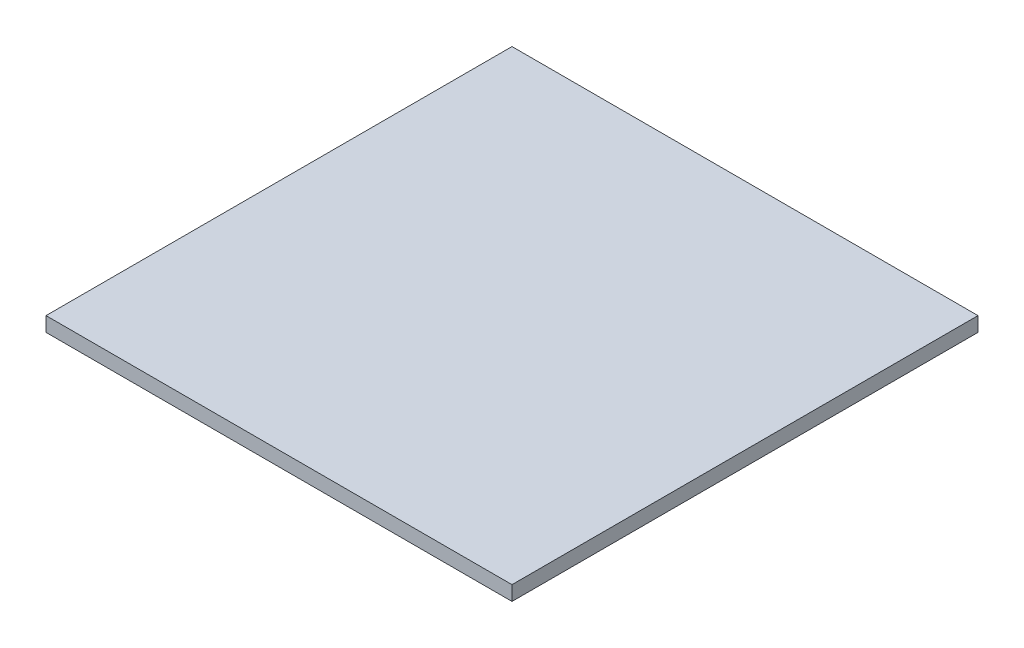
ISO-10303-21;
HEADER;
FILE_DESCRIPTION(('STEP AP214'),'2;1');
FILE_NAME('part.step','',(''),(''),'','','');
FILE_SCHEMA(('AUTOMOTIVE_DESIGN { 1 0 10303 214 1 1 1 1 }'));
ENDSEC;
DATA;
#1=APPLICATION_CONTEXT('core data for automotive mechanical design processes');
#2=APPLICATION_PROTOCOL_DEFINITION('international standard','automotive_design',2000,#1);
#3=PRODUCT_CONTEXT('',#1,'mechanical');
#4=PRODUCT('Part','Part','',(#3));
#5=PRODUCT_RELATED_PRODUCT_CATEGORY('part','',(#4));
#6=PRODUCT_DEFINITION_FORMATION('','',#4);
#7=PRODUCT_DEFINITION_CONTEXT('part definition',#1,'design');
#8=PRODUCT_DEFINITION('design','',#6,#7);
#9=PRODUCT_DEFINITION_SHAPE('','',#8);
#10=(LENGTH_UNIT() NAMED_UNIT(*) SI_UNIT(.MILLI.,.METRE.));
#11=(NAMED_UNIT(*) PLANE_ANGLE_UNIT() SI_UNIT($,.RADIAN.));
#12=(NAMED_UNIT(*) SI_UNIT($,.STERADIAN.) SOLID_ANGLE_UNIT());
#13=UNCERTAINTY_MEASURE_WITH_UNIT(LENGTH_MEASURE(1.E-05),#10,'distance_accuracy_value','');
#14=(GEOMETRIC_REPRESENTATION_CONTEXT(3) GLOBAL_UNCERTAINTY_ASSIGNED_CONTEXT((#13)) GLOBAL_UNIT_ASSIGNED_CONTEXT((#10,
#11,#12)) REPRESENTATION_CONTEXT('',''));
#15=CARTESIAN_POINT('',(0.,0.,0.));
#16=DIRECTION('',(0.,0.,1.));
#17=DIRECTION('',(1.,0.,0.));
#18=AXIS2_PLACEMENT_3D('',#15,#16,#17);
#19=CARTESIAN_POINT('',(0.,3.175,0.));
#20=DIRECTION('',(1.,0.,0.));
#21=DIRECTION('',(0.,0.,-1.));
#22=AXIS2_PLACEMENT_3D('',#19,#20,#21);
#23=PLANE('',#22);
#24=DIRECTION('',(0.,0.,1.));
#25=VECTOR('',#24,1.);
#26=CARTESIAN_POINT('',(0.,0.,0.));
#27=LINE('',#26,#25);
#28=CARTESIAN_POINT('',(0.,0.,-101.6));
#29=VERTEX_POINT('',#28);
#30=CARTESIAN_POINT('',(0.,0.,0.));
#31=VERTEX_POINT('',#30);
#32=EDGE_CURVE('E96',#29,#31,#27,.T.);
#33=ORIENTED_EDGE('',*,*,#32,.T.);
#34=DIRECTION('',(0.,-1.,0.));
#35=VECTOR('',#34,1.);
#36=CARTESIAN_POINT('',(0.,3.175,0.));
#37=LINE('',#36,#35);
#38=CARTESIAN_POINT('',(0.,3.175,0.));
#39=VERTEX_POINT('',#38);
#40=EDGE_CURVE('E11',#39,#31,#37,.T.);
#41=ORIENTED_EDGE('',*,*,#40,.F.);
#42=DIRECTION('',(0.,0.,1.));
#43=VECTOR('',#42,1.);
#44=CARTESIAN_POINT('',(0.,3.175,0.));
#45=LINE('',#44,#43);
#46=CARTESIAN_POINT('',(0.,3.175,-101.6));
#47=VERTEX_POINT('',#46);
#48=EDGE_CURVE('E84',#47,#39,#45,.T.);
#49=ORIENTED_EDGE('',*,*,#48,.F.);
#50=DIRECTION('',(0.,-1.,0.));
#51=VECTOR('',#50,1.);
#52=CARTESIAN_POINT('',(0.,3.175,-101.6));
#53=LINE('',#52,#51);
#54=EDGE_CURVE('E92',#47,#29,#53,.T.);
#55=ORIENTED_EDGE('',*,*,#54,.T.);
#56=EDGE_LOOP('',(#33,#41,#49,#55));
#57=FACE_BOUND('',#56,.T.);
#58=ADVANCED_FACE('F33',(#57),#23,.F.);
#59=CARTESIAN_POINT('',(0.,3.175,0.));
#60=DIRECTION('',(0.,0.,-1.));
#61=DIRECTION('',(-1.,0.,0.));
#62=AXIS2_PLACEMENT_3D('',#59,#60,#61);
#63=PLANE('',#62);
#64=DIRECTION('',(1.,0.,0.));
#65=VECTOR('',#64,1.);
#66=CARTESIAN_POINT('',(0.,0.,0.));
#67=LINE('',#66,#65);
#68=CARTESIAN_POINT('',(101.6,0.,0.));
#69=VERTEX_POINT('',#68);
#70=EDGE_CURVE('E88',#31,#69,#67,.T.);
#71=ORIENTED_EDGE('',*,*,#70,.T.);
#72=DIRECTION('',(0.,-1.,0.));
#73=VECTOR('',#72,1.);
#74=CARTESIAN_POINT('',(101.6,3.175,0.));
#75=LINE('',#74,#73);
#76=CARTESIAN_POINT('',(101.6,3.175,0.));
#77=VERTEX_POINT('',#76);
#78=EDGE_CURVE('E41',#77,#69,#75,.T.);
#79=ORIENTED_EDGE('',*,*,#78,.F.);
#80=DIRECTION('',(1.,0.,0.));
#81=VECTOR('',#80,1.);
#82=CARTESIAN_POINT('',(0.,3.175,0.));
#83=LINE('',#82,#81);
#84=EDGE_CURVE('E79',#39,#77,#83,.T.);
#85=ORIENTED_EDGE('',*,*,#84,.F.);
#86=ORIENTED_EDGE('',*,*,#40,.T.);
#87=EDGE_LOOP('',(#71,#79,#85,#86));
#88=FACE_BOUND('',#87,.T.);
#89=ADVANCED_FACE('F87',(#88),#63,.F.);
#90=CARTESIAN_POINT('',(101.6,3.175,0.));
#91=DIRECTION('',(-1.,0.,0.));
#92=DIRECTION('',(0.,0.,1.));
#93=AXIS2_PLACEMENT_3D('',#90,#91,#92);
#94=PLANE('',#93);
#95=DIRECTION('',(0.,0.,-1.));
#96=VECTOR('',#95,1.);
#97=CARTESIAN_POINT('',(101.6,0.,0.));
#98=LINE('',#97,#96);
#99=CARTESIAN_POINT('',(101.6,0.,-101.6));
#100=VERTEX_POINT('',#99);
#101=EDGE_CURVE('E66',#69,#100,#98,.T.);
#102=ORIENTED_EDGE('',*,*,#101,.T.);
#103=DIRECTION('',(0.,-1.,0.));
#104=VECTOR('',#103,1.);
#105=CARTESIAN_POINT('',(101.6,3.175,-101.6));
#106=LINE('',#105,#104);
#107=CARTESIAN_POINT('',(101.6,3.175,-101.6));
#108=VERTEX_POINT('',#107);
#109=EDGE_CURVE('E89',#108,#100,#106,.T.);
#110=ORIENTED_EDGE('',*,*,#109,.F.);
#111=DIRECTION('',(0.,0.,-1.));
#112=VECTOR('',#111,1.);
#113=CARTESIAN_POINT('',(101.6,3.175,0.));
#114=LINE('',#113,#112);
#115=EDGE_CURVE('E82',#77,#108,#114,.T.);
#116=ORIENTED_EDGE('',*,*,#115,.F.);
#117=ORIENTED_EDGE('',*,*,#78,.T.);
#118=EDGE_LOOP('',(#102,#110,#116,#117));
#119=FACE_BOUND('',#118,.T.);
#120=ADVANCED_FACE('F90',(#119),#94,.F.);
#121=CARTESIAN_POINT('',(0.,3.175,-101.6));
#122=DIRECTION('',(0.,0.,1.));
#123=DIRECTION('',(1.,0.,0.));
#124=AXIS2_PLACEMENT_3D('',#121,#122,#123);
#125=PLANE('',#124);
#126=DIRECTION('',(-1.,0.,0.));
#127=VECTOR('',#126,1.);
#128=CARTESIAN_POINT('',(0.,0.,-101.6));
#129=LINE('',#128,#127);
#130=EDGE_CURVE('E72',#100,#29,#129,.T.);
#131=ORIENTED_EDGE('',*,*,#130,.T.);
#132=ORIENTED_EDGE('',*,*,#54,.F.);
#133=DIRECTION('',(-1.,0.,0.));
#134=VECTOR('',#133,1.);
#135=CARTESIAN_POINT('',(0.,3.175,-101.6));
#136=LINE('',#135,#134);
#137=EDGE_CURVE('E49',#108,#47,#136,.T.);
#138=ORIENTED_EDGE('',*,*,#137,.F.);
#139=ORIENTED_EDGE('',*,*,#109,.T.);
#140=EDGE_LOOP('',(#131,#132,#138,#139));
#141=FACE_BOUND('',#140,.T.);
#142=ADVANCED_FACE('F103',(#141),#125,.F.);
#143=CARTESIAN_POINT('',(0.,3.175,0.));
#144=DIRECTION('',(0.,-1.,0.));
#145=DIRECTION('',(0.,0.,-1.));
#146=AXIS2_PLACEMENT_3D('',#143,#144,#145);
#147=PLANE('',#146);
#148=ORIENTED_EDGE('',*,*,#48,.T.);
#149=ORIENTED_EDGE('',*,*,#84,.T.);
#150=ORIENTED_EDGE('',*,*,#115,.T.);
#151=ORIENTED_EDGE('',*,*,#137,.T.);
#152=EDGE_LOOP('',(#148,#149,#150,#151));
#153=FACE_BOUND('',#152,.T.);
#154=ADVANCED_FACE('F80',(#153),#147,.F.);
#155=CARTESIAN_POINT('',(0.,0.,0.));
#156=DIRECTION('',(0.,-1.,0.));
#157=DIRECTION('',(0.,0.,-1.));
#158=AXIS2_PLACEMENT_3D('',#155,#156,#157);
#159=PLANE('',#158);
#160=ORIENTED_EDGE('',*,*,#32,.F.);
#161=ORIENTED_EDGE('',*,*,#130,.F.);
#162=ORIENTED_EDGE('',*,*,#101,.F.);
#163=ORIENTED_EDGE('',*,*,#70,.F.);
#164=EDGE_LOOP('',(#160,#161,#162,#163));
#165=FACE_BOUND('',#164,.T.);
#166=ADVANCED_FACE('F106',(#165),#159,.T.);
#167=CLOSED_SHELL('',(#58,#89,#120,#142,#154,#166));
#168=MANIFOLD_SOLID_BREP('B2',#167);
#169=ADVANCED_BREP_SHAPE_REPRESENTATION('',(#18,#168),#14);
#170=SHAPE_DEFINITION_REPRESENTATION(#9,#169);
ENDSEC;
END-ISO-10303-21;
